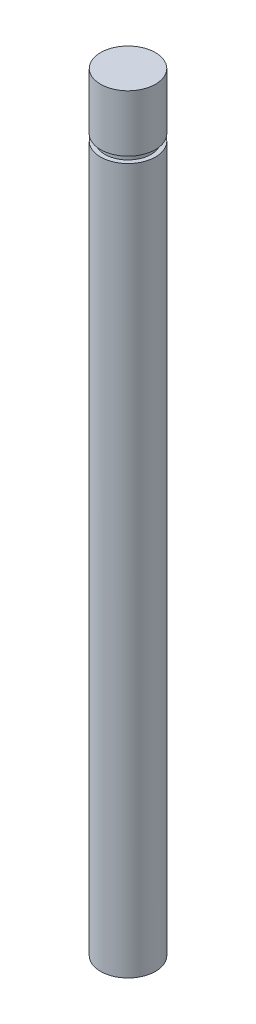
ISO-10303-21;
HEADER;
FILE_DESCRIPTION(('STEP AP214'),'2;1');
FILE_NAME('part.step','',(''),(''),'','','');
FILE_SCHEMA(('AUTOMOTIVE_DESIGN { 1 0 10303 214 1 1 1 1 }'));
ENDSEC;
DATA;
#1=APPLICATION_CONTEXT('core data for automotive mechanical design processes');
#2=APPLICATION_PROTOCOL_DEFINITION('international standard','automotive_design',2000,#1);
#3=PRODUCT_CONTEXT('',#1,'mechanical');
#4=PRODUCT('Part','Part','',(#3));
#5=PRODUCT_RELATED_PRODUCT_CATEGORY('part','',(#4));
#6=PRODUCT_DEFINITION_FORMATION('','',#4);
#7=PRODUCT_DEFINITION_CONTEXT('part definition',#1,'design');
#8=PRODUCT_DEFINITION('design','',#6,#7);
#9=PRODUCT_DEFINITION_SHAPE('','',#8);
#10=(LENGTH_UNIT() NAMED_UNIT(*) SI_UNIT(.MILLI.,.METRE.));
#11=(NAMED_UNIT(*) PLANE_ANGLE_UNIT() SI_UNIT($,.RADIAN.));
#12=(NAMED_UNIT(*) SI_UNIT($,.STERADIAN.) SOLID_ANGLE_UNIT());
#13=UNCERTAINTY_MEASURE_WITH_UNIT(LENGTH_MEASURE(1.E-05),#10,'distance_accuracy_value','');
#14=(GEOMETRIC_REPRESENTATION_CONTEXT(3) GLOBAL_UNCERTAINTY_ASSIGNED_CONTEXT((#13)) GLOBAL_UNIT_ASSIGNED_CONTEXT((#10,
#11,#12)) REPRESENTATION_CONTEXT('',''));
#15=CARTESIAN_POINT('',(0.,0.,0.));
#16=DIRECTION('',(0.,0.,1.));
#17=DIRECTION('',(1.,0.,0.));
#18=AXIS2_PLACEMENT_3D('',#15,#16,#17);
#19=CARTESIAN_POINT('',(0.,88.9,0.));
#20=DIRECTION('',(0.,-1.,0.));
#21=DIRECTION('',(0.,0.,-1.));
#22=AXIS2_PLACEMENT_3D('',#19,#20,#21);
#23=CYLINDRICAL_SURFACE('',#22,3.175);
#24=CARTESIAN_POINT('',(0.,50.8,0.));
#25=DIRECTION('',(0.,1.,0.));
#26=DIRECTION('',(0.,0.,1.));
#27=AXIS2_PLACEMENT_3D('',#24,#25,#26);
#28=CIRCLE('',#27,3.175);
#29=CARTESIAN_POINT('',(-2.5,50.8,-1.95719825260498));
#30=VERTEX_POINT('',#29);
#31=CARTESIAN_POINT('',(-2.5,50.8,1.95719825260498));
#32=VERTEX_POINT('',#31);
#33=EDGE_CURVE('E11',#30,#32,#28,.T.);
#34=ORIENTED_EDGE('',*,*,#33,.T.);
#35=DIRECTION('',(0.,-1.,0.));
#36=VECTOR('',#35,1.);
#37=CARTESIAN_POINT('',(-2.5,50.8,1.95719825260498));
#38=LINE('',#37,#36);
#39=CARTESIAN_POINT('',(-2.5,0.,1.95719825260498));
#40=VERTEX_POINT('',#39);
#41=EDGE_CURVE('E68',#32,#40,#38,.T.);
#42=ORIENTED_EDGE('',*,*,#41,.T.);
#43=CARTESIAN_POINT('',(0.,0.,0.));
#44=DIRECTION('',(0.,1.,0.));
#45=DIRECTION('',(0.,0.,1.));
#46=AXIS2_PLACEMENT_3D('',#43,#44,#45);
#47=CIRCLE('',#46,3.175);
#48=CARTESIAN_POINT('',(-2.5,0.,-1.95719825260498));
#49=VERTEX_POINT('',#48);
#50=EDGE_CURVE('E77',#40,#49,#47,.T.);
#51=ORIENTED_EDGE('',*,*,#50,.T.);
#52=DIRECTION('',(0.,-1.,0.));
#53=VECTOR('',#52,1.);
#54=CARTESIAN_POINT('',(-2.5,50.8,-1.95719825260498));
#55=LINE('',#54,#53);
#56=EDGE_CURVE('E54',#30,#49,#55,.T.);
#57=ORIENTED_EDGE('',*,*,#56,.F.);
#58=EDGE_LOOP('',(#34,#42,#51,#57));
#59=FACE_BOUND('',#58,.T.);
#60=CARTESIAN_POINT('',(0.,81.6102,0.));
#61=DIRECTION('',(0.,1.,0.));
#62=DIRECTION('',(0.,0.,1.));
#63=AXIS2_PLACEMENT_3D('',#60,#61,#62);
#64=CIRCLE('',#63,3.175);
#65=CARTESIAN_POINT('',(0.,81.6102,3.175));
#66=VERTEX_POINT('',#65);
#67=EDGE_CURVE('E73',#66,#66,#64,.T.);
#68=ORIENTED_EDGE('',*,*,#67,.F.);
#69=EDGE_LOOP('',(#68));
#70=FACE_BOUND('',#69,.T.);
#71=ADVANCED_FACE('F38',(#59,#70),#23,.T.);
#72=CARTESIAN_POINT('',(0.,0.,0.));
#73=DIRECTION('',(0.,1.,0.));
#74=DIRECTION('',(0.,0.,1.));
#75=AXIS2_PLACEMENT_3D('',#72,#73,#74);
#76=PLANE('',#75);
#77=ORIENTED_EDGE('',*,*,#50,.F.);
#78=DIRECTION('',(0.,0.,1.));
#79=VECTOR('',#78,1.);
#80=CARTESIAN_POINT('',(-2.5,0.,0.));
#81=LINE('',#80,#79);
#82=EDGE_CURVE('E65',#49,#40,#81,.T.);
#83=ORIENTED_EDGE('',*,*,#82,.F.);
#84=EDGE_LOOP('',(#77,#83));
#85=FACE_BOUND('',#84,.T.);
#86=ADVANCED_FACE('F80',(#85),#76,.F.);
#87=CARTESIAN_POINT('',(0.,50.8,0.));
#88=DIRECTION('',(0.,1.,0.));
#89=DIRECTION('',(0.,0.,1.));
#90=AXIS2_PLACEMENT_3D('',#87,#88,#89);
#91=PLANE('',#90);
#92=DIRECTION('',(0.,0.,1.));
#93=VECTOR('',#92,1.);
#94=CARTESIAN_POINT('',(-2.5,50.8,0.));
#95=LINE('',#94,#93);
#96=EDGE_CURVE('E61',#30,#32,#95,.T.);
#97=ORIENTED_EDGE('',*,*,#96,.T.);
#98=ORIENTED_EDGE('',*,*,#33,.F.);
#99=EDGE_LOOP('',(#97,#98));
#100=FACE_BOUND('',#99,.T.);
#101=ADVANCED_FACE('F121',(#100),#91,.F.);
#102=CARTESIAN_POINT('',(-2.5,50.8,0.));
#103=DIRECTION('',(1.,0.,0.));
#104=DIRECTION('',(0.,0.,-1.));
#105=AXIS2_PLACEMENT_3D('',#102,#103,#104);
#106=PLANE('',#105);
#107=ORIENTED_EDGE('',*,*,#82,.T.);
#108=ORIENTED_EDGE('',*,*,#41,.F.);
#109=ORIENTED_EDGE('',*,*,#96,.F.);
#110=ORIENTED_EDGE('',*,*,#56,.T.);
#111=EDGE_LOOP('',(#107,#108,#109,#110));
#112=FACE_BOUND('',#111,.T.);
#113=ADVANCED_FACE('F67',(#112),#106,.F.);
#114=CARTESIAN_POINT('',(0.,81.6102,0.));
#115=DIRECTION('',(0.,1.,0.));
#116=DIRECTION('',(0.,0.,1.));
#117=AXIS2_PLACEMENT_3D('',#114,#115,#116);
#118=PLANE('',#117);
#119=CARTESIAN_POINT('',(0.,81.6102,0.));
#120=DIRECTION('',(0.,1.,0.));
#121=DIRECTION('',(0.,0.,1.));
#122=AXIS2_PLACEMENT_3D('',#119,#120,#121);
#123=CIRCLE('',#122,2.667);
#124=CARTESIAN_POINT('',(0.,81.6102,2.667));
#125=VERTEX_POINT('',#124);
#126=EDGE_CURVE('E94',#125,#125,#123,.T.);
#127=ORIENTED_EDGE('',*,*,#126,.F.);
#128=EDGE_LOOP('',(#127));
#129=FACE_BOUND('',#128,.T.);
#130=ORIENTED_EDGE('',*,*,#67,.T.);
#131=EDGE_LOOP('',(#130));
#132=FACE_BOUND('',#131,.T.);
#133=ADVANCED_FACE('F109',(#129,#132),#118,.T.);
#134=CARTESIAN_POINT('',(0.,82.3468,0.));
#135=DIRECTION('',(0.,1.,0.));
#136=DIRECTION('',(0.,0.,1.));
#137=AXIS2_PLACEMENT_3D('',#134,#135,#136);
#138=PLANE('',#137);
#139=CARTESIAN_POINT('',(0.,82.3468,0.));
#140=DIRECTION('',(0.,1.,0.));
#141=DIRECTION('',(0.,0.,1.));
#142=AXIS2_PLACEMENT_3D('',#139,#140,#141);
#143=CIRCLE('',#142,2.667);
#144=CARTESIAN_POINT('',(0.,82.3468,2.667));
#145=VERTEX_POINT('',#144);
#146=EDGE_CURVE('E98',#145,#145,#143,.T.);
#147=ORIENTED_EDGE('',*,*,#146,.T.);
#148=EDGE_LOOP('',(#147));
#149=FACE_BOUND('',#148,.T.);
#150=CARTESIAN_POINT('',(0.,82.3468,0.));
#151=DIRECTION('',(0.,1.,0.));
#152=DIRECTION('',(0.,0.,1.));
#153=AXIS2_PLACEMENT_3D('',#150,#151,#152);
#154=CIRCLE('',#153,3.175);
#155=CARTESIAN_POINT('',(0.,82.3468,3.175));
#156=VERTEX_POINT('',#155);
#157=EDGE_CURVE('E90',#156,#156,#154,.T.);
#158=ORIENTED_EDGE('',*,*,#157,.F.);
#159=EDGE_LOOP('',(#158));
#160=FACE_BOUND('',#159,.T.);
#161=ADVANCED_FACE('F112',(#149,#160),#138,.F.);
#162=CARTESIAN_POINT('',(0.,81.6102,0.));
#163=DIRECTION('',(0.,1.,0.));
#164=DIRECTION('',(0.,0.,1.));
#165=AXIS2_PLACEMENT_3D('',#162,#163,#164);
#166=CYLINDRICAL_SURFACE('',#165,2.667);
#167=ORIENTED_EDGE('',*,*,#126,.T.);
#168=EDGE_LOOP('',(#167));
#169=FACE_BOUND('',#168,.T.);
#170=ORIENTED_EDGE('',*,*,#146,.F.);
#171=EDGE_LOOP('',(#170));
#172=FACE_BOUND('',#171,.T.);
#173=ADVANCED_FACE('F106',(#169,#172),#166,.T.);
#174=CARTESIAN_POINT('',(0.,88.9,0.));
#175=DIRECTION('',(0.,1.,0.));
#176=DIRECTION('',(0.,0.,1.));
#177=AXIS2_PLACEMENT_3D('',#174,#175,#176);
#178=PLANE('',#177);
#179=CARTESIAN_POINT('',(0.,88.9,0.));
#180=DIRECTION('',(0.,1.,0.));
#181=DIRECTION('',(0.,0.,1.));
#182=AXIS2_PLACEMENT_3D('',#179,#180,#181);
#183=CIRCLE('',#182,3.175);
#184=CARTESIAN_POINT('',(0.,88.9,3.175));
#185=VERTEX_POINT('',#184);
#186=EDGE_CURVE('E47',#185,#185,#183,.T.);
#187=ORIENTED_EDGE('',*,*,#186,.T.);
#188=EDGE_LOOP('',(#187));
#189=FACE_BOUND('',#188,.T.);
#190=ADVANCED_FACE('F123',(#189),#178,.T.);
#191=ORIENTED_EDGE('',*,*,#157,.T.);
#192=EDGE_LOOP('',(#191));
#193=FACE_BOUND('',#192,.T.);
#194=ORIENTED_EDGE('',*,*,#186,.F.);
#195=EDGE_LOOP('',(#194));
#196=FACE_BOUND('',#195,.T.);
#197=ADVANCED_FACE('F40',(#193,#196),#23,.T.);
#198=CLOSED_SHELL('',(#71,#86,#101,#113,#133,#161,#173,#190,#197));
#199=MANIFOLD_SOLID_BREP('B2',#198);
#200=ADVANCED_BREP_SHAPE_REPRESENTATION('',(#18,#199),#14);
#201=SHAPE_DEFINITION_REPRESENTATION(#9,#200);
ENDSEC;
END-ISO-10303-21;
